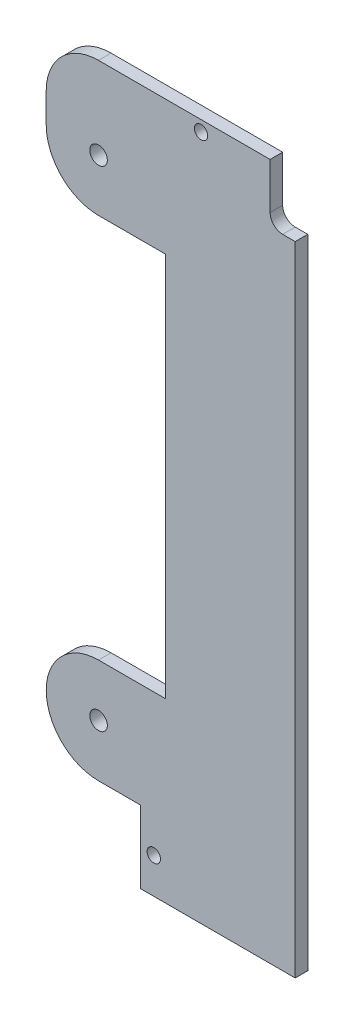
ISO-10303-21;
HEADER;
FILE_DESCRIPTION(('STEP AP214'),'2;1');
FILE_NAME('part.step','',(''),(''),'','','');
FILE_SCHEMA(('AUTOMOTIVE_DESIGN { 1 0 10303 214 1 1 1 1 }'));
ENDSEC;
DATA;
#1=APPLICATION_CONTEXT('core data for automotive mechanical design processes');
#2=APPLICATION_PROTOCOL_DEFINITION('international standard','automotive_design',2000,#1);
#3=PRODUCT_CONTEXT('',#1,'mechanical');
#4=PRODUCT('Part','Part','',(#3));
#5=PRODUCT_RELATED_PRODUCT_CATEGORY('part','',(#4));
#6=PRODUCT_DEFINITION_FORMATION('','',#4);
#7=PRODUCT_DEFINITION_CONTEXT('part definition',#1,'design');
#8=PRODUCT_DEFINITION('design','',#6,#7);
#9=PRODUCT_DEFINITION_SHAPE('','',#8);
#10=(LENGTH_UNIT() NAMED_UNIT(*) SI_UNIT(.MILLI.,.METRE.));
#11=(NAMED_UNIT(*) PLANE_ANGLE_UNIT() SI_UNIT($,.RADIAN.));
#12=(NAMED_UNIT(*) SI_UNIT($,.STERADIAN.) SOLID_ANGLE_UNIT());
#13=UNCERTAINTY_MEASURE_WITH_UNIT(LENGTH_MEASURE(1.E-05),#10,'distance_accuracy_value','');
#14=(GEOMETRIC_REPRESENTATION_CONTEXT(3) GLOBAL_UNCERTAINTY_ASSIGNED_CONTEXT((#13)) GLOBAL_UNIT_ASSIGNED_CONTEXT((#10,
#11,#12)) REPRESENTATION_CONTEXT('',''));
#15=CARTESIAN_POINT('',(0.,0.,0.));
#16=DIRECTION('',(0.,0.,1.));
#17=DIRECTION('',(1.,0.,0.));
#18=AXIS2_PLACEMENT_3D('',#15,#16,#17);
#19=CARTESIAN_POINT('',(0.,0.,3.));
#20=DIRECTION('',(0.,0.,1.));
#21=DIRECTION('',(1.,0.,0.));
#22=AXIS2_PLACEMENT_3D('',#19,#20,#21);
#23=PLANE('',#22);
#24=CARTESIAN_POINT('',(13.2,-21.3,3.));
#25=DIRECTION('',(0.,0.,1.));
#26=DIRECTION('',(1.,0.,0.));
#27=AXIS2_PLACEMENT_3D('',#24,#25,#26);
#28=CIRCLE('',#27,1.6);
#29=CARTESIAN_POINT('',(14.8,-21.3,3.));
#30=VERTEX_POINT('',#29);
#31=EDGE_CURVE('E535',#30,#30,#28,.T.);
#32=ORIENTED_EDGE('',*,*,#31,.F.);
#33=EDGE_LOOP('',(#32));
#34=FACE_BOUND('',#33,.T.);
#35=CARTESIAN_POINT('',(0.,0.,3.));
#36=DIRECTION('',(0.,0.,1.));
#37=DIRECTION('',(1.,0.,0.));
#38=AXIS2_PLACEMENT_3D('',#35,#36,#37);
#39=CIRCLE('',#38,2.1);
#40=CARTESIAN_POINT('',(2.1,0.,3.));
#41=VERTEX_POINT('',#40);
#42=EDGE_CURVE('E199',#41,#41,#39,.T.);
#43=ORIENTED_EDGE('',*,*,#42,.F.);
#44=EDGE_LOOP('',(#43));
#45=FACE_BOUND('',#44,.T.);
#46=DIRECTION('',(0.,1.,0.));
#47=VECTOR('',#46,1.);
#48=CARTESIAN_POINT('',(47.,122.6,3.));
#49=LINE('',#48,#47);
#50=CARTESIAN_POINT('',(47.,-29.8,3.));
#51=VERTEX_POINT('',#50);
#52=CARTESIAN_POINT('',(47.,122.6,3.));
#53=VERTEX_POINT('',#52);
#54=EDGE_CURVE('E230',#51,#53,#49,.T.);
#55=ORIENTED_EDGE('',*,*,#54,.T.);
#56=DIRECTION('',(-1.,0.,0.));
#57=VECTOR('',#56,1.);
#58=CARTESIAN_POINT('',(44.,122.6,3.));
#59=LINE('',#58,#57);
#60=CARTESIAN_POINT('',(44.,122.6,3.));
#61=VERTEX_POINT('',#60);
#62=EDGE_CURVE('E127',#53,#61,#59,.T.);
#63=ORIENTED_EDGE('',*,*,#62,.T.);
#64=CARTESIAN_POINT('',(44.,125.6,3.));
#65=DIRECTION('',(0.,0.,-1.));
#66=DIRECTION('',(1.,0.,0.));
#67=AXIS2_PLACEMENT_3D('',#64,#65,#66);
#68=CIRCLE('',#67,2.99999999999999);
#69=CARTESIAN_POINT('',(41.,125.6,3.));
#70=VERTEX_POINT('',#69);
#71=EDGE_CURVE('E269',#61,#70,#68,.T.);
#72=ORIENTED_EDGE('',*,*,#71,.T.);
#73=DIRECTION('',(0.,1.,0.));
#74=VECTOR('',#73,1.);
#75=CARTESIAN_POINT('',(41.,136.6,3.));
#76=LINE('',#75,#74);
#77=CARTESIAN_POINT('',(41.,136.6,3.));
#78=VERTEX_POINT('',#77);
#79=EDGE_CURVE('E288',#70,#78,#76,.T.);
#80=ORIENTED_EDGE('',*,*,#79,.T.);
#81=DIRECTION('',(-1.,0.,0.));
#82=VECTOR('',#81,1.);
#83=CARTESIAN_POINT('',(0.,136.6,3.));
#84=LINE('',#83,#82);
#85=CARTESIAN_POINT('',(0.,136.6,3.));
#86=VERTEX_POINT('',#85);
#87=EDGE_CURVE('E285',#78,#86,#84,.T.);
#88=ORIENTED_EDGE('',*,*,#87,.T.);
#89=CARTESIAN_POINT('',(0.,124.1,3.));
#90=DIRECTION('',(0.,0.,1.));
#91=DIRECTION('',(1.,0.,0.));
#92=AXIS2_PLACEMENT_3D('',#89,#90,#91);
#93=CIRCLE('',#92,12.5);
#94=CARTESIAN_POINT('',(-12.5,124.1,3.));
#95=VERTEX_POINT('',#94);
#96=EDGE_CURVE('E287',#86,#95,#93,.T.);
#97=ORIENTED_EDGE('',*,*,#96,.T.);
#98=DIRECTION('',(0.,-1.,0.));
#99=VECTOR('',#98,1.);
#100=CARTESIAN_POINT('',(-12.5,124.1,3.));
#101=LINE('',#100,#99);
#102=CARTESIAN_POINT('',(-12.5,117.,3.));
#103=VERTEX_POINT('',#102);
#104=EDGE_CURVE('E290',#95,#103,#101,.T.);
#105=ORIENTED_EDGE('',*,*,#104,.T.);
#106=CARTESIAN_POINT('',(0.,117.,3.));
#107=DIRECTION('',(0.,0.,1.));
#108=DIRECTION('',(1.,0.,0.));
#109=AXIS2_PLACEMENT_3D('',#106,#107,#108);
#110=CIRCLE('',#109,12.5);
#111=CARTESIAN_POINT('',(0.,104.5,3.));
#112=VERTEX_POINT('',#111);
#113=EDGE_CURVE('E296',#103,#112,#110,.T.);
#114=ORIENTED_EDGE('',*,*,#113,.T.);
#115=DIRECTION('',(1.,0.,0.));
#116=VECTOR('',#115,1.);
#117=CARTESIAN_POINT('',(0.,104.5,3.));
#118=LINE('',#117,#116);
#119=CARTESIAN_POINT('',(16.,104.5,3.));
#120=VERTEX_POINT('',#119);
#121=EDGE_CURVE('E298',#112,#120,#118,.T.);
#122=ORIENTED_EDGE('',*,*,#121,.T.);
#123=DIRECTION('',(0.,-1.,0.));
#124=VECTOR('',#123,1.);
#125=CARTESIAN_POINT('',(16.,104.5,3.));
#126=LINE('',#125,#124);
#127=CARTESIAN_POINT('',(16.,12.5,3.));
#128=VERTEX_POINT('',#127);
#129=EDGE_CURVE('E300',#120,#128,#126,.T.);
#130=ORIENTED_EDGE('',*,*,#129,.T.);
#131=DIRECTION('',(-1.,0.,0.));
#132=VECTOR('',#131,1.);
#133=CARTESIAN_POINT('',(0.,12.5,3.));
#134=LINE('',#133,#132);
#135=CARTESIAN_POINT('',(0.,12.5,3.));
#136=VERTEX_POINT('',#135);
#137=EDGE_CURVE('E303',#128,#136,#134,.T.);
#138=ORIENTED_EDGE('',*,*,#137,.T.);
#139=CARTESIAN_POINT('',(0.,0.,3.));
#140=DIRECTION('',(0.,0.,1.));
#141=DIRECTION('',(1.,0.,0.));
#142=AXIS2_PLACEMENT_3D('',#139,#140,#141);
#143=CIRCLE('',#142,12.5);
#144=CARTESIAN_POINT('',(1.30930550206618E-13,-12.5,3.));
#145=VERTEX_POINT('',#144);
#146=EDGE_CURVE('E171',#136,#145,#143,.T.);
#147=ORIENTED_EDGE('',*,*,#146,.T.);
#148=DIRECTION('',(1.,0.,0.));
#149=VECTOR('',#148,1.);
#150=CARTESIAN_POINT('',(1.30930550206618E-13,-12.5,3.));
#151=LINE('',#150,#149);
#152=CARTESIAN_POINT('',(10.,-12.5,3.));
#153=VERTEX_POINT('',#152);
#154=EDGE_CURVE('E165',#145,#153,#151,.T.);
#155=ORIENTED_EDGE('',*,*,#154,.T.);
#156=DIRECTION('',(0.,-1.,0.));
#157=VECTOR('',#156,1.);
#158=CARTESIAN_POINT('',(10.,-29.8,3.));
#159=LINE('',#158,#157);
#160=CARTESIAN_POINT('',(10.,-29.8,3.));
#161=VERTEX_POINT('',#160);
#162=EDGE_CURVE('E169',#153,#161,#159,.T.);
#163=ORIENTED_EDGE('',*,*,#162,.T.);
#164=DIRECTION('',(1.,0.,0.));
#165=VECTOR('',#164,1.);
#166=CARTESIAN_POINT('',(10.,-29.8,3.));
#167=LINE('',#166,#165);
#168=EDGE_CURVE('E59',#161,#51,#167,.T.);
#169=ORIENTED_EDGE('',*,*,#168,.T.);
#170=EDGE_LOOP('',(#55,#63,#72,#80,#88,#97,#105,#114,#122,#130,#138,#147,#155,#163,#169));
#171=FACE_BOUND('',#170,.T.);
#172=CARTESIAN_POINT('',(0.,117.,3.));
#173=DIRECTION('',(0.,0.,1.));
#174=DIRECTION('',(1.,0.,0.));
#175=AXIS2_PLACEMENT_3D('',#172,#173,#174);
#176=CIRCLE('',#175,2.1);
#177=CARTESIAN_POINT('',(2.1,117.,3.));
#178=VERTEX_POINT('',#177);
#179=EDGE_CURVE('E312',#178,#178,#176,.T.);
#180=ORIENTED_EDGE('',*,*,#179,.F.);
#181=EDGE_LOOP('',(#180));
#182=FACE_BOUND('',#181,.T.);
#183=CARTESIAN_POINT('',(24.5,134.,3.));
#184=DIRECTION('',(0.,0.,1.));
#185=DIRECTION('',(1.,0.,0.));
#186=AXIS2_PLACEMENT_3D('',#183,#184,#185);
#187=CIRCLE('',#186,1.59999999999999);
#188=CARTESIAN_POINT('',(26.1,134.,3.));
#189=VERTEX_POINT('',#188);
#190=EDGE_CURVE('E526',#189,#189,#187,.T.);
#191=ORIENTED_EDGE('',*,*,#190,.F.);
#192=EDGE_LOOP('',(#191));
#193=FACE_BOUND('',#192,.T.);
#194=ADVANCED_FACE('F42',(#34,#45,#171,#182,#193),#23,.T.);
#195=CARTESIAN_POINT('',(0.,0.,0.));
#196=DIRECTION('',(0.,0.,1.));
#197=DIRECTION('',(1.,0.,0.));
#198=AXIS2_PLACEMENT_3D('',#195,#196,#197);
#199=PLANE('',#198);
#200=CARTESIAN_POINT('',(13.2,-21.3,0.));
#201=DIRECTION('',(0.,0.,1.));
#202=DIRECTION('',(1.,0.,0.));
#203=AXIS2_PLACEMENT_3D('',#200,#201,#202);
#204=CIRCLE('',#203,1.6);
#205=CARTESIAN_POINT('',(14.8,-21.3,0.));
#206=VERTEX_POINT('',#205);
#207=EDGE_CURVE('E532',#206,#206,#204,.T.);
#208=ORIENTED_EDGE('',*,*,#207,.T.);
#209=EDGE_LOOP('',(#208));
#210=FACE_BOUND('',#209,.T.);
#211=CARTESIAN_POINT('',(0.,0.,0.));
#212=DIRECTION('',(0.,0.,1.));
#213=DIRECTION('',(1.,0.,0.));
#214=AXIS2_PLACEMENT_3D('',#211,#212,#213);
#215=CIRCLE('',#214,2.1);
#216=CARTESIAN_POINT('',(2.1,0.,0.));
#217=VERTEX_POINT('',#216);
#218=EDGE_CURVE('E308',#217,#217,#215,.T.);
#219=ORIENTED_EDGE('',*,*,#218,.T.);
#220=EDGE_LOOP('',(#219));
#221=FACE_BOUND('',#220,.T.);
#222=DIRECTION('',(0.,1.,0.));
#223=VECTOR('',#222,1.);
#224=CARTESIAN_POINT('',(47.,122.6,0.));
#225=LINE('',#224,#223);
#226=CARTESIAN_POINT('',(47.,-29.8,0.));
#227=VERTEX_POINT('',#226);
#228=CARTESIAN_POINT('',(47.,122.6,0.));
#229=VERTEX_POINT('',#228);
#230=EDGE_CURVE('E194',#227,#229,#225,.T.);
#231=ORIENTED_EDGE('',*,*,#230,.F.);
#232=DIRECTION('',(1.,0.,0.));
#233=VECTOR('',#232,1.);
#234=CARTESIAN_POINT('',(10.,-29.8,0.));
#235=LINE('',#234,#233);
#236=CARTESIAN_POINT('',(10.,-29.8,0.));
#237=VERTEX_POINT('',#236);
#238=EDGE_CURVE('E119',#237,#227,#235,.T.);
#239=ORIENTED_EDGE('',*,*,#238,.F.);
#240=DIRECTION('',(0.,-1.,0.));
#241=VECTOR('',#240,1.);
#242=CARTESIAN_POINT('',(10.,-29.8,0.));
#243=LINE('',#242,#241);
#244=CARTESIAN_POINT('',(10.,-12.5,0.));
#245=VERTEX_POINT('',#244);
#246=EDGE_CURVE('E113',#245,#237,#243,.T.);
#247=ORIENTED_EDGE('',*,*,#246,.F.);
#248=DIRECTION('',(1.,0.,0.));
#249=VECTOR('',#248,1.);
#250=CARTESIAN_POINT('',(1.30930550206618E-13,-12.5,0.));
#251=LINE('',#250,#249);
#252=CARTESIAN_POINT('',(1.30930550206618E-13,-12.5,0.));
#253=VERTEX_POINT('',#252);
#254=EDGE_CURVE('E180',#253,#245,#251,.T.);
#255=ORIENTED_EDGE('',*,*,#254,.F.);
#256=CARTESIAN_POINT('',(0.,0.,0.));
#257=DIRECTION('',(0.,0.,1.));
#258=DIRECTION('',(1.,0.,0.));
#259=AXIS2_PLACEMENT_3D('',#256,#257,#258);
#260=CIRCLE('',#259,12.5);
#261=CARTESIAN_POINT('',(0.,12.5,0.));
#262=VERTEX_POINT('',#261);
#263=EDGE_CURVE('E221',#262,#253,#260,.T.);
#264=ORIENTED_EDGE('',*,*,#263,.F.);
#265=DIRECTION('',(-1.,0.,0.));
#266=VECTOR('',#265,1.);
#267=CARTESIAN_POINT('',(0.,12.5,0.));
#268=LINE('',#267,#266);
#269=CARTESIAN_POINT('',(16.,12.5,0.));
#270=VERTEX_POINT('',#269);
#271=EDGE_CURVE('E218',#270,#262,#268,.T.);
#272=ORIENTED_EDGE('',*,*,#271,.F.);
#273=DIRECTION('',(0.,-1.,0.));
#274=VECTOR('',#273,1.);
#275=CARTESIAN_POINT('',(16.,104.5,0.));
#276=LINE('',#275,#274);
#277=CARTESIAN_POINT('',(16.,104.5,0.));
#278=VERTEX_POINT('',#277);
#279=EDGE_CURVE('E215',#278,#270,#276,.T.);
#280=ORIENTED_EDGE('',*,*,#279,.F.);
#281=DIRECTION('',(1.,0.,0.));
#282=VECTOR('',#281,1.);
#283=CARTESIAN_POINT('',(0.,104.5,0.));
#284=LINE('',#283,#282);
#285=CARTESIAN_POINT('',(0.,104.5,0.));
#286=VERTEX_POINT('',#285);
#287=EDGE_CURVE('E213',#286,#278,#284,.T.);
#288=ORIENTED_EDGE('',*,*,#287,.F.);
#289=CARTESIAN_POINT('',(0.,117.,0.));
#290=DIRECTION('',(0.,0.,1.));
#291=DIRECTION('',(1.,0.,0.));
#292=AXIS2_PLACEMENT_3D('',#289,#290,#291);
#293=CIRCLE('',#292,12.5);
#294=CARTESIAN_POINT('',(-12.5,117.,0.));
#295=VERTEX_POINT('',#294);
#296=EDGE_CURVE('E211',#295,#286,#293,.T.);
#297=ORIENTED_EDGE('',*,*,#296,.F.);
#298=DIRECTION('',(0.,-1.,0.));
#299=VECTOR('',#298,1.);
#300=CARTESIAN_POINT('',(-12.5,124.1,0.));
#301=LINE('',#300,#299);
#302=CARTESIAN_POINT('',(-12.5,124.1,0.));
#303=VERTEX_POINT('',#302);
#304=EDGE_CURVE('E209',#303,#295,#301,.T.);
#305=ORIENTED_EDGE('',*,*,#304,.F.);
#306=CARTESIAN_POINT('',(0.,124.1,0.));
#307=DIRECTION('',(0.,0.,1.));
#308=DIRECTION('',(1.,0.,0.));
#309=AXIS2_PLACEMENT_3D('',#306,#307,#308);
#310=CIRCLE('',#309,12.5);
#311=CARTESIAN_POINT('',(0.,136.6,0.));
#312=VERTEX_POINT('',#311);
#313=EDGE_CURVE('E207',#312,#303,#310,.T.);
#314=ORIENTED_EDGE('',*,*,#313,.F.);
#315=DIRECTION('',(-1.,0.,0.));
#316=VECTOR('',#315,1.);
#317=CARTESIAN_POINT('',(0.,136.6,0.));
#318=LINE('',#317,#316);
#319=CARTESIAN_POINT('',(41.,136.6,0.));
#320=VERTEX_POINT('',#319);
#321=EDGE_CURVE('E205',#320,#312,#318,.T.);
#322=ORIENTED_EDGE('',*,*,#321,.F.);
#323=DIRECTION('',(0.,1.,0.));
#324=VECTOR('',#323,1.);
#325=CARTESIAN_POINT('',(41.,136.6,0.));
#326=LINE('',#325,#324);
#327=CARTESIAN_POINT('',(41.,125.6,0.));
#328=VERTEX_POINT('',#327);
#329=EDGE_CURVE('E203',#328,#320,#326,.T.);
#330=ORIENTED_EDGE('',*,*,#329,.F.);
#331=CARTESIAN_POINT('',(44.,125.6,0.));
#332=DIRECTION('',(0.,0.,-1.));
#333=DIRECTION('',(1.,0.,0.));
#334=AXIS2_PLACEMENT_3D('',#331,#332,#333);
#335=CIRCLE('',#334,2.99999999999999);
#336=CARTESIAN_POINT('',(44.,122.6,0.));
#337=VERTEX_POINT('',#336);
#338=EDGE_CURVE('E201',#337,#328,#335,.T.);
#339=ORIENTED_EDGE('',*,*,#338,.F.);
#340=DIRECTION('',(-1.,0.,0.));
#341=VECTOR('',#340,1.);
#342=CARTESIAN_POINT('',(44.,122.6,0.));
#343=LINE('',#342,#341);
#344=EDGE_CURVE('E198',#229,#337,#343,.T.);
#345=ORIENTED_EDGE('',*,*,#344,.F.);
#346=EDGE_LOOP('',(#231,#239,#247,#255,#264,#272,#280,#288,#297,#305,#314,#322,#330,#339,#345));
#347=FACE_BOUND('',#346,.T.);
#348=CARTESIAN_POINT('',(0.,117.,0.));
#349=DIRECTION('',(0.,0.,1.));
#350=DIRECTION('',(1.,0.,0.));
#351=AXIS2_PLACEMENT_3D('',#348,#349,#350);
#352=CIRCLE('',#351,2.1);
#353=CARTESIAN_POINT('',(2.1,117.,0.));
#354=VERTEX_POINT('',#353);
#355=EDGE_CURVE('E317',#354,#354,#352,.T.);
#356=ORIENTED_EDGE('',*,*,#355,.T.);
#357=EDGE_LOOP('',(#356));
#358=FACE_BOUND('',#357,.T.);
#359=CARTESIAN_POINT('',(24.5,134.,0.));
#360=DIRECTION('',(0.,0.,1.));
#361=DIRECTION('',(1.,0.,0.));
#362=AXIS2_PLACEMENT_3D('',#359,#360,#361);
#363=CIRCLE('',#362,1.59999999999999);
#364=CARTESIAN_POINT('',(26.1,134.,0.));
#365=VERTEX_POINT('',#364);
#366=EDGE_CURVE('E529',#365,#365,#363,.T.);
#367=ORIENTED_EDGE('',*,*,#366,.T.);
#368=EDGE_LOOP('',(#367));
#369=FACE_BOUND('',#368,.T.);
#370=ADVANCED_FACE('F273',(#210,#221,#347,#358,#369),#199,.F.);
#371=CARTESIAN_POINT('',(47.,122.6,3.));
#372=DIRECTION('',(-1.,0.,0.));
#373=DIRECTION('',(0.,-1.,0.));
#374=AXIS2_PLACEMENT_3D('',#371,#372,#373);
#375=PLANE('',#374);
#376=ORIENTED_EDGE('',*,*,#230,.T.);
#377=DIRECTION('',(0.,0.,-1.));
#378=VECTOR('',#377,1.);
#379=CARTESIAN_POINT('',(47.,122.6,3.));
#380=LINE('',#379,#378);
#381=EDGE_CURVE('E11',#53,#229,#380,.T.);
#382=ORIENTED_EDGE('',*,*,#381,.F.);
#383=ORIENTED_EDGE('',*,*,#54,.F.);
#384=DIRECTION('',(0.,0.,-1.));
#385=VECTOR('',#384,1.);
#386=CARTESIAN_POINT('',(47.,-29.8,3.));
#387=LINE('',#386,#385);
#388=EDGE_CURVE('E190',#51,#227,#387,.T.);
#389=ORIENTED_EDGE('',*,*,#388,.T.);
#390=EDGE_LOOP('',(#376,#382,#383,#389));
#391=FACE_BOUND('',#390,.T.);
#392=ADVANCED_FACE('F44',(#391),#375,.F.);
#393=CARTESIAN_POINT('',(44.,122.6,3.));
#394=DIRECTION('',(0.,-1.,0.));
#395=DIRECTION('',(1.,0.,0.));
#396=AXIS2_PLACEMENT_3D('',#393,#394,#395);
#397=PLANE('',#396);
#398=ORIENTED_EDGE('',*,*,#344,.T.);
#399=DIRECTION('',(0.,0.,-1.));
#400=VECTOR('',#399,1.);
#401=CARTESIAN_POINT('',(44.,122.6,3.));
#402=LINE('',#401,#400);
#403=EDGE_CURVE('E51',#61,#337,#402,.T.);
#404=ORIENTED_EDGE('',*,*,#403,.F.);
#405=ORIENTED_EDGE('',*,*,#62,.F.);
#406=ORIENTED_EDGE('',*,*,#381,.T.);
#407=EDGE_LOOP('',(#398,#404,#405,#406));
#408=FACE_BOUND('',#407,.T.);
#409=ADVANCED_FACE('F326',(#408),#397,.F.);
#410=CARTESIAN_POINT('',(44.,125.6,3.));
#411=DIRECTION('',(0.,0.,-1.));
#412=DIRECTION('',(-1.,0.,0.));
#413=AXIS2_PLACEMENT_3D('',#410,#411,#412);
#414=CYLINDRICAL_SURFACE('',#413,2.99999999999999);
#415=ORIENTED_EDGE('',*,*,#338,.T.);
#416=DIRECTION('',(0.,0.,-1.));
#417=VECTOR('',#416,1.);
#418=CARTESIAN_POINT('',(41.,125.6,3.));
#419=LINE('',#418,#417);
#420=EDGE_CURVE('E261',#70,#328,#419,.T.);
#421=ORIENTED_EDGE('',*,*,#420,.F.);
#422=ORIENTED_EDGE('',*,*,#71,.F.);
#423=ORIENTED_EDGE('',*,*,#403,.T.);
#424=EDGE_LOOP('',(#415,#421,#422,#423));
#425=FACE_BOUND('',#424,.T.);
#426=ADVANCED_FACE('F267',(#425),#414,.F.);
#427=CARTESIAN_POINT('',(41.,136.6,3.));
#428=DIRECTION('',(-1.,0.,0.));
#429=DIRECTION('',(0.,0.,1.));
#430=AXIS2_PLACEMENT_3D('',#427,#428,#429);
#431=PLANE('',#430);
#432=ORIENTED_EDGE('',*,*,#329,.T.);
#433=DIRECTION('',(0.,0.,-1.));
#434=VECTOR('',#433,1.);
#435=CARTESIAN_POINT('',(41.,136.6,3.));
#436=LINE('',#435,#434);
#437=EDGE_CURVE('E258',#78,#320,#436,.T.);
#438=ORIENTED_EDGE('',*,*,#437,.F.);
#439=ORIENTED_EDGE('',*,*,#79,.F.);
#440=ORIENTED_EDGE('',*,*,#420,.T.);
#441=EDGE_LOOP('',(#432,#438,#439,#440));
#442=FACE_BOUND('',#441,.T.);
#443=ADVANCED_FACE('F279',(#442),#431,.F.);
#444=CARTESIAN_POINT('',(0.,136.6,3.));
#445=DIRECTION('',(0.,-1.,0.));
#446=DIRECTION('',(0.,0.,-1.));
#447=AXIS2_PLACEMENT_3D('',#444,#445,#446);
#448=PLANE('',#447);
#449=ORIENTED_EDGE('',*,*,#321,.T.);
#450=DIRECTION('',(0.,0.,-1.));
#451=VECTOR('',#450,1.);
#452=CARTESIAN_POINT('',(0.,136.6,3.));
#453=LINE('',#452,#451);
#454=EDGE_CURVE('E255',#86,#312,#453,.T.);
#455=ORIENTED_EDGE('',*,*,#454,.F.);
#456=ORIENTED_EDGE('',*,*,#87,.F.);
#457=ORIENTED_EDGE('',*,*,#437,.T.);
#458=EDGE_LOOP('',(#449,#455,#456,#457));
#459=FACE_BOUND('',#458,.T.);
#460=ADVANCED_FACE('F283',(#459),#448,.F.);
#461=CARTESIAN_POINT('',(0.,124.1,3.));
#462=DIRECTION('',(0.,0.,-1.));
#463=DIRECTION('',(-1.,0.,0.));
#464=AXIS2_PLACEMENT_3D('',#461,#462,#463);
#465=CYLINDRICAL_SURFACE('',#464,12.5);
#466=ORIENTED_EDGE('',*,*,#313,.T.);
#467=DIRECTION('',(0.,0.,-1.));
#468=VECTOR('',#467,1.);
#469=CARTESIAN_POINT('',(-12.5,124.1,3.));
#470=LINE('',#469,#468);
#471=EDGE_CURVE('E252',#95,#303,#470,.T.);
#472=ORIENTED_EDGE('',*,*,#471,.F.);
#473=ORIENTED_EDGE('',*,*,#96,.F.);
#474=ORIENTED_EDGE('',*,*,#454,.T.);
#475=EDGE_LOOP('',(#466,#472,#473,#474));
#476=FACE_BOUND('',#475,.T.);
#477=ADVANCED_FACE('F377',(#476),#465,.T.);
#478=CARTESIAN_POINT('',(-12.5,124.1,3.));
#479=DIRECTION('',(1.,0.,0.));
#480=DIRECTION('',(0.,1.,0.));
#481=AXIS2_PLACEMENT_3D('',#478,#479,#480);
#482=PLANE('',#481);
#483=ORIENTED_EDGE('',*,*,#304,.T.);
#484=DIRECTION('',(0.,0.,-1.));
#485=VECTOR('',#484,1.);
#486=CARTESIAN_POINT('',(-12.5,117.,3.));
#487=LINE('',#486,#485);
#488=EDGE_CURVE('E249',#103,#295,#487,.T.);
#489=ORIENTED_EDGE('',*,*,#488,.F.);
#490=ORIENTED_EDGE('',*,*,#104,.F.);
#491=ORIENTED_EDGE('',*,*,#471,.T.);
#492=EDGE_LOOP('',(#483,#489,#490,#491));
#493=FACE_BOUND('',#492,.T.);
#494=ADVANCED_FACE('F373',(#493),#482,.F.);
#495=CARTESIAN_POINT('',(0.,117.,3.));
#496=DIRECTION('',(0.,0.,-1.));
#497=DIRECTION('',(-1.,0.,0.));
#498=AXIS2_PLACEMENT_3D('',#495,#496,#497);
#499=CYLINDRICAL_SURFACE('',#498,12.5);
#500=ORIENTED_EDGE('',*,*,#296,.T.);
#501=DIRECTION('',(0.,0.,-1.));
#502=VECTOR('',#501,1.);
#503=CARTESIAN_POINT('',(0.,104.5,3.));
#504=LINE('',#503,#502);
#505=EDGE_CURVE('E246',#112,#286,#504,.T.);
#506=ORIENTED_EDGE('',*,*,#505,.F.);
#507=ORIENTED_EDGE('',*,*,#113,.F.);
#508=ORIENTED_EDGE('',*,*,#488,.T.);
#509=EDGE_LOOP('',(#500,#506,#507,#508));
#510=FACE_BOUND('',#509,.T.);
#511=ADVANCED_FACE('F369',(#510),#499,.T.);
#512=CARTESIAN_POINT('',(0.,104.5,3.));
#513=DIRECTION('',(0.,1.,0.));
#514=DIRECTION('',(0.,0.,1.));
#515=AXIS2_PLACEMENT_3D('',#512,#513,#514);
#516=PLANE('',#515);
#517=ORIENTED_EDGE('',*,*,#287,.T.);
#518=DIRECTION('',(0.,0.,-1.));
#519=VECTOR('',#518,1.);
#520=CARTESIAN_POINT('',(16.,104.5,3.));
#521=LINE('',#520,#519);
#522=EDGE_CURVE('E243',#120,#278,#521,.T.);
#523=ORIENTED_EDGE('',*,*,#522,.F.);
#524=ORIENTED_EDGE('',*,*,#121,.F.);
#525=ORIENTED_EDGE('',*,*,#505,.T.);
#526=EDGE_LOOP('',(#517,#523,#524,#525));
#527=FACE_BOUND('',#526,.T.);
#528=ADVANCED_FACE('F365',(#527),#516,.F.);
#529=CARTESIAN_POINT('',(16.,104.5,3.));
#530=DIRECTION('',(1.,0.,0.));
#531=DIRECTION('',(0.,1.,0.));
#532=AXIS2_PLACEMENT_3D('',#529,#530,#531);
#533=PLANE('',#532);
#534=ORIENTED_EDGE('',*,*,#279,.T.);
#535=DIRECTION('',(0.,0.,-1.));
#536=VECTOR('',#535,1.);
#537=CARTESIAN_POINT('',(16.,12.5,3.));
#538=LINE('',#537,#536);
#539=EDGE_CURVE('E239',#128,#270,#538,.T.);
#540=ORIENTED_EDGE('',*,*,#539,.F.);
#541=ORIENTED_EDGE('',*,*,#129,.F.);
#542=ORIENTED_EDGE('',*,*,#522,.T.);
#543=EDGE_LOOP('',(#534,#540,#541,#542));
#544=FACE_BOUND('',#543,.T.);
#545=ADVANCED_FACE('F361',(#544),#533,.F.);
#546=CARTESIAN_POINT('',(0.,12.5,3.));
#547=DIRECTION('',(0.,-1.,0.));
#548=DIRECTION('',(0.,0.,-1.));
#549=AXIS2_PLACEMENT_3D('',#546,#547,#548);
#550=PLANE('',#549);
#551=ORIENTED_EDGE('',*,*,#271,.T.);
#552=DIRECTION('',(0.,0.,-1.));
#553=VECTOR('',#552,1.);
#554=CARTESIAN_POINT('',(0.,12.5,3.));
#555=LINE('',#554,#553);
#556=EDGE_CURVE('E235',#136,#262,#555,.T.);
#557=ORIENTED_EDGE('',*,*,#556,.F.);
#558=ORIENTED_EDGE('',*,*,#137,.F.);
#559=ORIENTED_EDGE('',*,*,#539,.T.);
#560=EDGE_LOOP('',(#551,#557,#558,#559));
#561=FACE_BOUND('',#560,.T.);
#562=ADVANCED_FACE('F357',(#561),#550,.F.);
#563=CARTESIAN_POINT('',(0.,0.,3.));
#564=DIRECTION('',(0.,0.,-1.));
#565=DIRECTION('',(-1.,0.,0.));
#566=AXIS2_PLACEMENT_3D('',#563,#564,#565);
#567=CYLINDRICAL_SURFACE('',#566,12.5);
#568=ORIENTED_EDGE('',*,*,#263,.T.);
#569=DIRECTION('',(0.,0.,-1.));
#570=VECTOR('',#569,1.);
#571=CARTESIAN_POINT('',(1.30930550206618E-13,-12.5,3.));
#572=LINE('',#571,#570);
#573=EDGE_CURVE('E182',#145,#253,#572,.T.);
#574=ORIENTED_EDGE('',*,*,#573,.F.);
#575=ORIENTED_EDGE('',*,*,#146,.F.);
#576=ORIENTED_EDGE('',*,*,#556,.T.);
#577=EDGE_LOOP('',(#568,#574,#575,#576));
#578=FACE_BOUND('',#577,.T.);
#579=ADVANCED_FACE('F354',(#578),#567,.T.);
#580=CARTESIAN_POINT('',(1.30930550206618E-13,-12.5,3.));
#581=DIRECTION('',(0.,1.,0.));
#582=DIRECTION('',(0.,0.,1.));
#583=AXIS2_PLACEMENT_3D('',#580,#581,#582);
#584=PLANE('',#583);
#585=ORIENTED_EDGE('',*,*,#254,.T.);
#586=DIRECTION('',(0.,0.,-1.));
#587=VECTOR('',#586,1.);
#588=CARTESIAN_POINT('',(10.,-12.5,3.));
#589=LINE('',#588,#587);
#590=EDGE_CURVE('E177',#153,#245,#589,.T.);
#591=ORIENTED_EDGE('',*,*,#590,.F.);
#592=ORIENTED_EDGE('',*,*,#154,.F.);
#593=ORIENTED_EDGE('',*,*,#573,.T.);
#594=EDGE_LOOP('',(#585,#591,#592,#593));
#595=FACE_BOUND('',#594,.T.);
#596=ADVANCED_FACE('F178',(#595),#584,.F.);
#597=CARTESIAN_POINT('',(10.,-29.8,3.));
#598=DIRECTION('',(1.,0.,0.));
#599=DIRECTION('',(0.,1.,0.));
#600=AXIS2_PLACEMENT_3D('',#597,#598,#599);
#601=PLANE('',#600);
#602=ORIENTED_EDGE('',*,*,#246,.T.);
#603=DIRECTION('',(0.,0.,-1.));
#604=VECTOR('',#603,1.);
#605=CARTESIAN_POINT('',(10.,-29.8,3.));
#606=LINE('',#605,#604);
#607=EDGE_CURVE('E183',#161,#237,#606,.T.);
#608=ORIENTED_EDGE('',*,*,#607,.F.);
#609=ORIENTED_EDGE('',*,*,#162,.F.);
#610=ORIENTED_EDGE('',*,*,#590,.T.);
#611=EDGE_LOOP('',(#602,#608,#609,#610));
#612=FACE_BOUND('',#611,.T.);
#613=ADVANCED_FACE('F185',(#612),#601,.F.);
#614=CARTESIAN_POINT('',(10.,-29.8,3.));
#615=DIRECTION('',(0.,1.,0.));
#616=DIRECTION('',(0.,0.,1.));
#617=AXIS2_PLACEMENT_3D('',#614,#615,#616);
#618=PLANE('',#617);
#619=ORIENTED_EDGE('',*,*,#238,.T.);
#620=ORIENTED_EDGE('',*,*,#388,.F.);
#621=ORIENTED_EDGE('',*,*,#168,.F.);
#622=ORIENTED_EDGE('',*,*,#607,.T.);
#623=EDGE_LOOP('',(#619,#620,#621,#622));
#624=FACE_BOUND('',#623,.T.);
#625=ADVANCED_FACE('F347',(#624),#618,.F.);
#626=CARTESIAN_POINT('',(0.,0.,3.));
#627=DIRECTION('',(0.,0.,-1.));
#628=DIRECTION('',(-1.,0.,0.));
#629=AXIS2_PLACEMENT_3D('',#626,#627,#628);
#630=CYLINDRICAL_SURFACE('',#629,2.1);
#631=ORIENTED_EDGE('',*,*,#42,.T.);
#632=EDGE_LOOP('',(#631));
#633=FACE_BOUND('',#632,.T.);
#634=ORIENTED_EDGE('',*,*,#218,.F.);
#635=EDGE_LOOP('',(#634));
#636=FACE_BOUND('',#635,.T.);
#637=ADVANCED_FACE('F344',(#633,#636),#630,.F.);
#638=CARTESIAN_POINT('',(0.,117.,3.));
#639=DIRECTION('',(0.,0.,-1.));
#640=DIRECTION('',(-1.,0.,0.));
#641=AXIS2_PLACEMENT_3D('',#638,#639,#640);
#642=CYLINDRICAL_SURFACE('',#641,2.1);
#643=ORIENTED_EDGE('',*,*,#179,.T.);
#644=EDGE_LOOP('',(#643));
#645=FACE_BOUND('',#644,.T.);
#646=ORIENTED_EDGE('',*,*,#355,.F.);
#647=EDGE_LOOP('',(#646));
#648=FACE_BOUND('',#647,.T.);
#649=ADVANCED_FACE('F438',(#645,#648),#642,.F.);
#650=CARTESIAN_POINT('',(13.2,-21.3,3.));
#651=DIRECTION('',(0.,0.,-1.));
#652=DIRECTION('',(-1.,0.,0.));
#653=AXIS2_PLACEMENT_3D('',#650,#651,#652);
#654=CYLINDRICAL_SURFACE('',#653,1.6);
#655=ORIENTED_EDGE('',*,*,#31,.T.);
#656=EDGE_LOOP('',(#655));
#657=FACE_BOUND('',#656,.T.);
#658=ORIENTED_EDGE('',*,*,#207,.F.);
#659=EDGE_LOOP('',(#658));
#660=FACE_BOUND('',#659,.T.);
#661=ADVANCED_FACE('F445',(#657,#660),#654,.F.);
#662=CARTESIAN_POINT('',(24.5,134.,3.));
#663=DIRECTION('',(0.,0.,-1.));
#664=DIRECTION('',(-1.,0.,0.));
#665=AXIS2_PLACEMENT_3D('',#662,#663,#664);
#666=CYLINDRICAL_SURFACE('',#665,1.59999999999999);
#667=ORIENTED_EDGE('',*,*,#190,.T.);
#668=EDGE_LOOP('',(#667));
#669=FACE_BOUND('',#668,.T.);
#670=ORIENTED_EDGE('',*,*,#366,.F.);
#671=EDGE_LOOP('',(#670));
#672=FACE_BOUND('',#671,.T.);
#673=ADVANCED_FACE('F452',(#669,#672),#666,.F.);
#674=CLOSED_SHELL('',(#194,#370,#392,#409,#426,#443,#460,#477,#494,#511,#528,#545,#562,#579,
#596,#613,#625,#637,#649,#661,#673));
#675=MANIFOLD_SOLID_BREP('B2',#674);
#676=ADVANCED_BREP_SHAPE_REPRESENTATION('',(#18,#675),#14);
#677=SHAPE_DEFINITION_REPRESENTATION(#9,#676);
ENDSEC;
END-ISO-10303-21;
